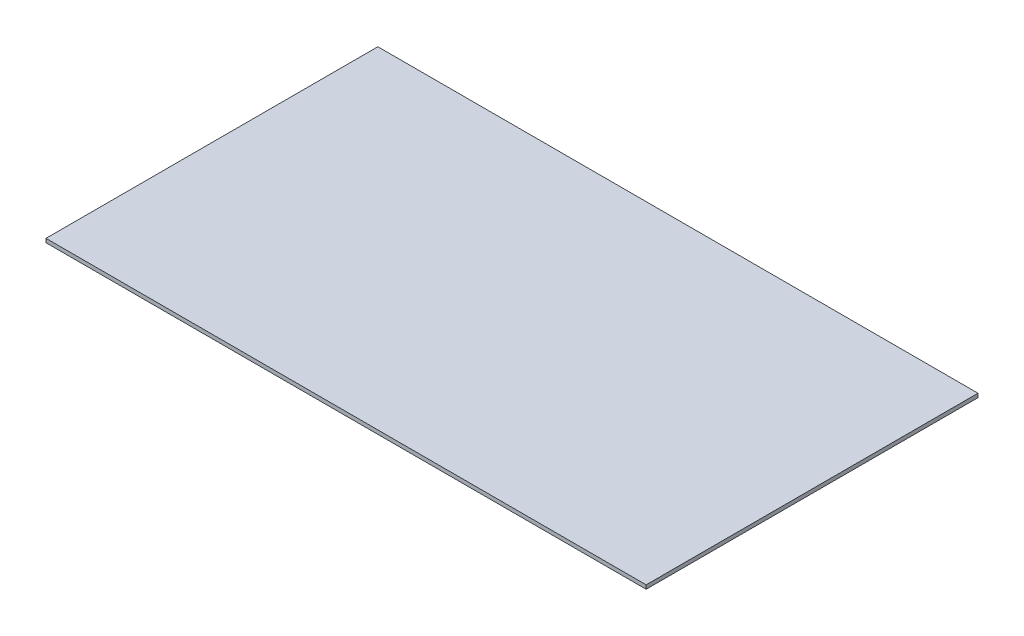
ISO-10303-21;
HEADER;
FILE_DESCRIPTION(('STEP AP214'),'2;1');
FILE_NAME('part.step','',(''),(''),'','','');
FILE_SCHEMA(('AUTOMOTIVE_DESIGN { 1 0 10303 214 1 1 1 1 }'));
ENDSEC;
DATA;
#1=APPLICATION_CONTEXT('core data for automotive mechanical design processes');
#2=APPLICATION_PROTOCOL_DEFINITION('international standard','automotive_design',2000,#1);
#3=PRODUCT_CONTEXT('',#1,'mechanical');
#4=PRODUCT('Part','Part','',(#3));
#5=PRODUCT_RELATED_PRODUCT_CATEGORY('part','',(#4));
#6=PRODUCT_DEFINITION_FORMATION('','',#4);
#7=PRODUCT_DEFINITION_CONTEXT('part definition',#1,'design');
#8=PRODUCT_DEFINITION('design','',#6,#7);
#9=PRODUCT_DEFINITION_SHAPE('','',#8);
#10=(LENGTH_UNIT() NAMED_UNIT(*) SI_UNIT(.MILLI.,.METRE.));
#11=(NAMED_UNIT(*) PLANE_ANGLE_UNIT() SI_UNIT($,.RADIAN.));
#12=(NAMED_UNIT(*) SI_UNIT($,.STERADIAN.) SOLID_ANGLE_UNIT());
#13=UNCERTAINTY_MEASURE_WITH_UNIT(LENGTH_MEASURE(1.E-05),#10,'distance_accuracy_value','');
#14=(GEOMETRIC_REPRESENTATION_CONTEXT(3) GLOBAL_UNCERTAINTY_ASSIGNED_CONTEXT((#13)) GLOBAL_UNIT_ASSIGNED_CONTEXT((#10,
#11,#12)) REPRESENTATION_CONTEXT('',''));
#15=CARTESIAN_POINT('',(0.,0.,0.));
#16=DIRECTION('',(0.,0.,1.));
#17=DIRECTION('',(1.,0.,0.));
#18=AXIS2_PLACEMENT_3D('',#15,#16,#17);
#19=CARTESIAN_POINT('',(-128.412698412698,1.6,-73.6621933621934));
#20=DIRECTION('',(1.,0.,0.));
#21=DIRECTION('',(0.,0.,-1.));
#22=AXIS2_PLACEMENT_3D('',#19,#20,#21);
#23=PLANE('',#22);
#24=DIRECTION('',(0.,0.,1.));
#25=VECTOR('',#24,1.);
#26=CARTESIAN_POINT('',(-128.412698412698,0.,-73.6621933621934));
#27=LINE('',#26,#25);
#28=CARTESIAN_POINT('',(-128.412698412698,0.,-73.6621933621934));
#29=VERTEX_POINT('',#28);
#30=CARTESIAN_POINT('',(-128.412698412698,0.,64.0896103896104));
#31=VERTEX_POINT('',#30);
#32=EDGE_CURVE('E94',#29,#31,#27,.T.);
#33=ORIENTED_EDGE('',*,*,#32,.T.);
#34=DIRECTION('',(0.,-1.,0.));
#35=VECTOR('',#34,1.);
#36=CARTESIAN_POINT('',(-128.412698412698,1.6,64.0896103896104));
#37=LINE('',#36,#35);
#38=CARTESIAN_POINT('',(-128.412698412698,1.6,64.0896103896104));
#39=VERTEX_POINT('',#38);
#40=EDGE_CURVE('E11',#39,#31,#37,.T.);
#41=ORIENTED_EDGE('',*,*,#40,.F.);
#42=DIRECTION('',(0.,0.,1.));
#43=VECTOR('',#42,1.);
#44=CARTESIAN_POINT('',(-128.412698412698,1.6,-73.6621933621934));
#45=LINE('',#44,#43);
#46=CARTESIAN_POINT('',(-128.412698412698,1.6,-73.6621933621934));
#47=VERTEX_POINT('',#46);
#48=EDGE_CURVE('E82',#47,#39,#45,.T.);
#49=ORIENTED_EDGE('',*,*,#48,.F.);
#50=DIRECTION('',(0.,-1.,0.));
#51=VECTOR('',#50,1.);
#52=CARTESIAN_POINT('',(-128.412698412698,1.6,-73.6621933621934));
#53=LINE('',#52,#51);
#54=EDGE_CURVE('E90',#47,#29,#53,.T.);
#55=ORIENTED_EDGE('',*,*,#54,.T.);
#56=EDGE_LOOP('',(#33,#41,#49,#55));
#57=FACE_BOUND('',#56,.T.);
#58=ADVANCED_FACE('F31',(#57),#23,.F.);
#59=CARTESIAN_POINT('',(-128.412698412698,1.6,64.0896103896104));
#60=DIRECTION('',(0.,0.,-1.));
#61=DIRECTION('',(-1.,0.,0.));
#62=AXIS2_PLACEMENT_3D('',#59,#60,#61);
#63=PLANE('',#62);
#64=DIRECTION('',(1.,0.,0.));
#65=VECTOR('',#64,1.);
#66=CARTESIAN_POINT('',(-128.412698412698,0.,64.0896103896104));
#67=LINE('',#66,#65);
#68=CARTESIAN_POINT('',(120.707936507937,0.,64.0896103896104));
#69=VERTEX_POINT('',#68);
#70=EDGE_CURVE('E86',#31,#69,#67,.T.);
#71=ORIENTED_EDGE('',*,*,#70,.T.);
#72=DIRECTION('',(0.,-1.,0.));
#73=VECTOR('',#72,1.);
#74=CARTESIAN_POINT('',(120.707936507937,1.6,64.0896103896104));
#75=LINE('',#74,#73);
#76=CARTESIAN_POINT('',(120.707936507937,1.6,64.0896103896104));
#77=VERTEX_POINT('',#76);
#78=EDGE_CURVE('E39',#77,#69,#75,.T.);
#79=ORIENTED_EDGE('',*,*,#78,.F.);
#80=DIRECTION('',(1.,0.,0.));
#81=VECTOR('',#80,1.);
#82=CARTESIAN_POINT('',(-128.412698412698,1.6,64.0896103896104));
#83=LINE('',#82,#81);
#84=EDGE_CURVE('E77',#39,#77,#83,.T.);
#85=ORIENTED_EDGE('',*,*,#84,.F.);
#86=ORIENTED_EDGE('',*,*,#40,.T.);
#87=EDGE_LOOP('',(#71,#79,#85,#86));
#88=FACE_BOUND('',#87,.T.);
#89=ADVANCED_FACE('F85',(#88),#63,.F.);
#90=CARTESIAN_POINT('',(120.707936507937,1.6,-73.6621933621934));
#91=DIRECTION('',(-1.,0.,0.));
#92=DIRECTION('',(0.,0.,1.));
#93=AXIS2_PLACEMENT_3D('',#90,#91,#92);
#94=PLANE('',#93);
#95=DIRECTION('',(0.,0.,-1.));
#96=VECTOR('',#95,1.);
#97=CARTESIAN_POINT('',(120.707936507937,0.,-73.6621933621934));
#98=LINE('',#97,#96);
#99=CARTESIAN_POINT('',(120.707936507937,0.,-73.6621933621934));
#100=VERTEX_POINT('',#99);
#101=EDGE_CURVE('E64',#69,#100,#98,.T.);
#102=ORIENTED_EDGE('',*,*,#101,.T.);
#103=DIRECTION('',(0.,-1.,0.));
#104=VECTOR('',#103,1.);
#105=CARTESIAN_POINT('',(120.707936507937,1.6,-73.6621933621934));
#106=LINE('',#105,#104);
#107=CARTESIAN_POINT('',(120.707936507937,1.6,-73.6621933621934));
#108=VERTEX_POINT('',#107);
#109=EDGE_CURVE('E87',#108,#100,#106,.T.);
#110=ORIENTED_EDGE('',*,*,#109,.F.);
#111=DIRECTION('',(0.,0.,-1.));
#112=VECTOR('',#111,1.);
#113=CARTESIAN_POINT('',(120.707936507937,1.6,-73.6621933621934));
#114=LINE('',#113,#112);
#115=EDGE_CURVE('E80',#77,#108,#114,.T.);
#116=ORIENTED_EDGE('',*,*,#115,.F.);
#117=ORIENTED_EDGE('',*,*,#78,.T.);
#118=EDGE_LOOP('',(#102,#110,#116,#117));
#119=FACE_BOUND('',#118,.T.);
#120=ADVANCED_FACE('F88',(#119),#94,.F.);
#121=CARTESIAN_POINT('',(-128.412698412698,1.6,-73.6621933621934));
#122=DIRECTION('',(0.,0.,1.));
#123=DIRECTION('',(1.,0.,0.));
#124=AXIS2_PLACEMENT_3D('',#121,#122,#123);
#125=PLANE('',#124);
#126=DIRECTION('',(-1.,0.,0.));
#127=VECTOR('',#126,1.);
#128=CARTESIAN_POINT('',(-128.412698412698,0.,-73.6621933621934));
#129=LINE('',#128,#127);
#130=EDGE_CURVE('E70',#100,#29,#129,.T.);
#131=ORIENTED_EDGE('',*,*,#130,.T.);
#132=ORIENTED_EDGE('',*,*,#54,.F.);
#133=DIRECTION('',(-1.,0.,0.));
#134=VECTOR('',#133,1.);
#135=CARTESIAN_POINT('',(-128.412698412698,1.6,-73.6621933621934));
#136=LINE('',#135,#134);
#137=EDGE_CURVE('E47',#108,#47,#136,.T.);
#138=ORIENTED_EDGE('',*,*,#137,.F.);
#139=ORIENTED_EDGE('',*,*,#109,.T.);
#140=EDGE_LOOP('',(#131,#132,#138,#139));
#141=FACE_BOUND('',#140,.T.);
#142=ADVANCED_FACE('F101',(#141),#125,.F.);
#143=CARTESIAN_POINT('',(-128.412698412698,1.6,64.0896103896104));
#144=DIRECTION('',(0.,1.,0.));
#145=DIRECTION('',(0.,0.,1.));
#146=AXIS2_PLACEMENT_3D('',#143,#144,#145);
#147=PLANE('',#146);
#148=ORIENTED_EDGE('',*,*,#48,.T.);
#149=ORIENTED_EDGE('',*,*,#84,.T.);
#150=ORIENTED_EDGE('',*,*,#115,.T.);
#151=ORIENTED_EDGE('',*,*,#137,.T.);
#152=EDGE_LOOP('',(#148,#149,#150,#151));
#153=FACE_BOUND('',#152,.T.);
#154=ADVANCED_FACE('F78',(#153),#147,.T.);
#155=CARTESIAN_POINT('',(-128.412698412698,0.,64.0896103896104));
#156=DIRECTION('',(0.,1.,0.));
#157=DIRECTION('',(0.,0.,1.));
#158=AXIS2_PLACEMENT_3D('',#155,#156,#157);
#159=PLANE('',#158);
#160=ORIENTED_EDGE('',*,*,#32,.F.);
#161=ORIENTED_EDGE('',*,*,#130,.F.);
#162=ORIENTED_EDGE('',*,*,#101,.F.);
#163=ORIENTED_EDGE('',*,*,#70,.F.);
#164=EDGE_LOOP('',(#160,#161,#162,#163));
#165=FACE_BOUND('',#164,.T.);
#166=ADVANCED_FACE('F104',(#165),#159,.F.);
#167=CLOSED_SHELL('',(#58,#89,#120,#142,#154,#166));
#168=MANIFOLD_SOLID_BREP('B2',#167);
#169=ADVANCED_BREP_SHAPE_REPRESENTATION('',(#18,#168),#14);
#170=SHAPE_DEFINITION_REPRESENTATION(#9,#169);
ENDSEC;
END-ISO-10303-21;
